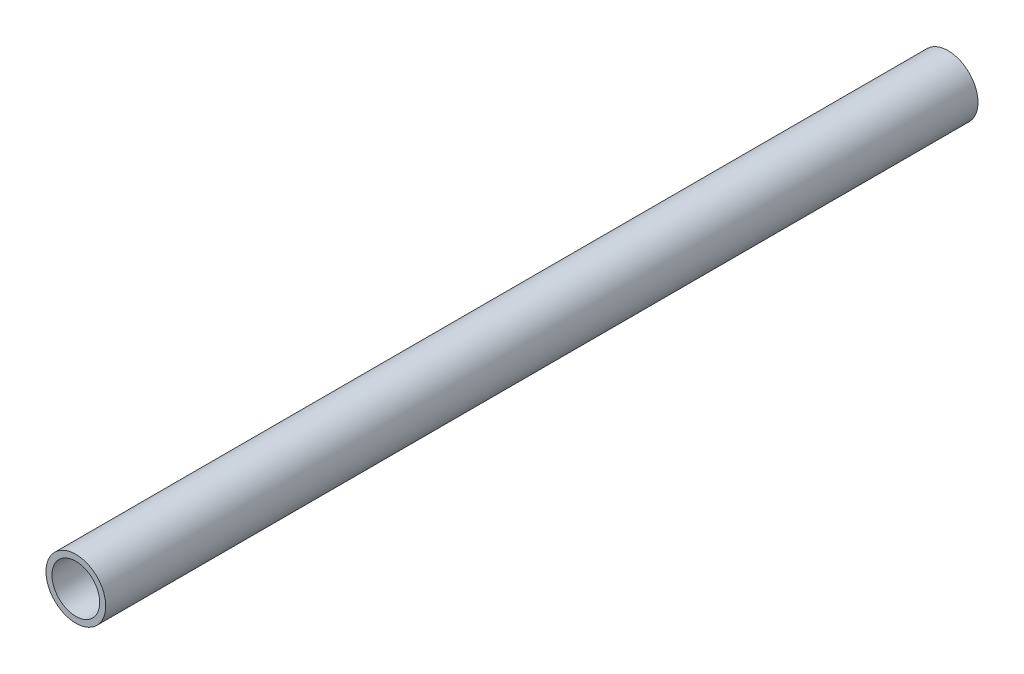
ISO-10303-21;
HEADER;
FILE_DESCRIPTION(('STEP AP214'),'2;1');
FILE_NAME('part.step','',(''),(''),'','','');
FILE_SCHEMA(('AUTOMOTIVE_DESIGN { 1 0 10303 214 1 1 1 1 }'));
ENDSEC;
DATA;
#1=APPLICATION_CONTEXT('core data for automotive mechanical design processes');
#2=APPLICATION_PROTOCOL_DEFINITION('international standard','automotive_design',2000,#1);
#3=PRODUCT_CONTEXT('',#1,'mechanical');
#4=PRODUCT('Part','Part','',(#3));
#5=PRODUCT_RELATED_PRODUCT_CATEGORY('part','',(#4));
#6=PRODUCT_DEFINITION_FORMATION('','',#4);
#7=PRODUCT_DEFINITION_CONTEXT('part definition',#1,'design');
#8=PRODUCT_DEFINITION('design','',#6,#7);
#9=PRODUCT_DEFINITION_SHAPE('','',#8);
#10=(LENGTH_UNIT() NAMED_UNIT(*) SI_UNIT(.MILLI.,.METRE.));
#11=(NAMED_UNIT(*) PLANE_ANGLE_UNIT() SI_UNIT($,.RADIAN.));
#12=(NAMED_UNIT(*) SI_UNIT($,.STERADIAN.) SOLID_ANGLE_UNIT());
#13=UNCERTAINTY_MEASURE_WITH_UNIT(LENGTH_MEASURE(1.E-05),#10,'distance_accuracy_value','');
#14=(GEOMETRIC_REPRESENTATION_CONTEXT(3) GLOBAL_UNCERTAINTY_ASSIGNED_CONTEXT((#13)) GLOBAL_UNIT_ASSIGNED_CONTEXT((#10,
#11,#12)) REPRESENTATION_CONTEXT('',''));
#15=CARTESIAN_POINT('',(0.,0.,0.));
#16=DIRECTION('',(0.,0.,1.));
#17=DIRECTION('',(1.,0.,0.));
#18=AXIS2_PLACEMENT_3D('',#15,#16,#17);
#19=CARTESIAN_POINT('',(0.,0.,73.));
#20=DIRECTION('',(0.,0.,1.));
#21=DIRECTION('',(1.,0.,0.));
#22=AXIS2_PLACEMENT_3D('',#19,#20,#21);
#23=PLANE('',#22);
#24=CARTESIAN_POINT('',(0.,0.,73.));
#25=DIRECTION('',(0.,0.,1.));
#26=DIRECTION('',(1.,0.,0.));
#27=AXIS2_PLACEMENT_3D('',#24,#25,#26);
#28=CIRCLE('',#27,2.5);
#29=CARTESIAN_POINT('',(2.5,0.,73.));
#30=VERTEX_POINT('',#29);
#31=EDGE_CURVE('E10',#30,#30,#28,.T.);
#32=ORIENTED_EDGE('',*,*,#31,.T.);
#33=EDGE_LOOP('',(#32));
#34=FACE_BOUND('',#33,.T.);
#35=CARTESIAN_POINT('',(0.,0.,73.));
#36=DIRECTION('',(0.,0.,1.));
#37=DIRECTION('',(1.,0.,0.));
#38=AXIS2_PLACEMENT_3D('',#35,#36,#37);
#39=CIRCLE('',#38,2.);
#40=CARTESIAN_POINT('',(2.,0.,73.));
#41=VERTEX_POINT('',#40);
#42=EDGE_CURVE('E42',#41,#41,#39,.T.);
#43=ORIENTED_EDGE('',*,*,#42,.F.);
#44=EDGE_LOOP('',(#43));
#45=FACE_BOUND('',#44,.T.);
#46=ADVANCED_FACE('F31',(#34,#45),#23,.T.);
#47=CARTESIAN_POINT('',(0.,0.,0.));
#48=DIRECTION('',(0.,0.,1.));
#49=DIRECTION('',(1.,0.,0.));
#50=AXIS2_PLACEMENT_3D('',#47,#48,#49);
#51=PLANE('',#50);
#52=CARTESIAN_POINT('',(0.,0.,0.));
#53=DIRECTION('',(0.,0.,1.));
#54=DIRECTION('',(1.,0.,0.));
#55=AXIS2_PLACEMENT_3D('',#52,#53,#54);
#56=CIRCLE('',#55,2.5);
#57=CARTESIAN_POINT('',(2.5,0.,0.));
#58=VERTEX_POINT('',#57);
#59=EDGE_CURVE('E35',#58,#58,#56,.T.);
#60=ORIENTED_EDGE('',*,*,#59,.F.);
#61=EDGE_LOOP('',(#60));
#62=FACE_BOUND('',#61,.T.);
#63=CARTESIAN_POINT('',(0.,0.,0.));
#64=DIRECTION('',(0.,0.,1.));
#65=DIRECTION('',(1.,0.,0.));
#66=AXIS2_PLACEMENT_3D('',#63,#64,#65);
#67=CIRCLE('',#66,2.);
#68=CARTESIAN_POINT('',(2.,0.,0.));
#69=VERTEX_POINT('',#68);
#70=EDGE_CURVE('E44',#69,#69,#67,.T.);
#71=ORIENTED_EDGE('',*,*,#70,.T.);
#72=EDGE_LOOP('',(#71));
#73=FACE_BOUND('',#72,.T.);
#74=ADVANCED_FACE('F54',(#62,#73),#51,.F.);
#75=CARTESIAN_POINT('',(0.,0.,73.));
#76=DIRECTION('',(0.,0.,-1.));
#77=DIRECTION('',(-1.,0.,0.));
#78=AXIS2_PLACEMENT_3D('',#75,#76,#77);
#79=CYLINDRICAL_SURFACE('',#78,2.5);
#80=ORIENTED_EDGE('',*,*,#31,.F.);
#81=EDGE_LOOP('',(#80));
#82=FACE_BOUND('',#81,.T.);
#83=ORIENTED_EDGE('',*,*,#59,.T.);
#84=EDGE_LOOP('',(#83));
#85=FACE_BOUND('',#84,.T.);
#86=ADVANCED_FACE('F33',(#82,#85),#79,.T.);
#87=CARTESIAN_POINT('',(0.,0.,73.));
#88=DIRECTION('',(0.,0.,-1.));
#89=DIRECTION('',(-1.,0.,0.));
#90=AXIS2_PLACEMENT_3D('',#87,#88,#89);
#91=CYLINDRICAL_SURFACE('',#90,2.);
#92=ORIENTED_EDGE('',*,*,#42,.T.);
#93=EDGE_LOOP('',(#92));
#94=FACE_BOUND('',#93,.T.);
#95=ORIENTED_EDGE('',*,*,#70,.F.);
#96=EDGE_LOOP('',(#95));
#97=FACE_BOUND('',#96,.T.);
#98=ADVANCED_FACE('F50',(#94,#97),#91,.F.);
#99=CLOSED_SHELL('',(#46,#74,#86,#98));
#100=MANIFOLD_SOLID_BREP('B2',#99);
#101=ADVANCED_BREP_SHAPE_REPRESENTATION('',(#18,#100),#14);
#102=SHAPE_DEFINITION_REPRESENTATION(#9,#101);
ENDSEC;
END-ISO-10303-21;
